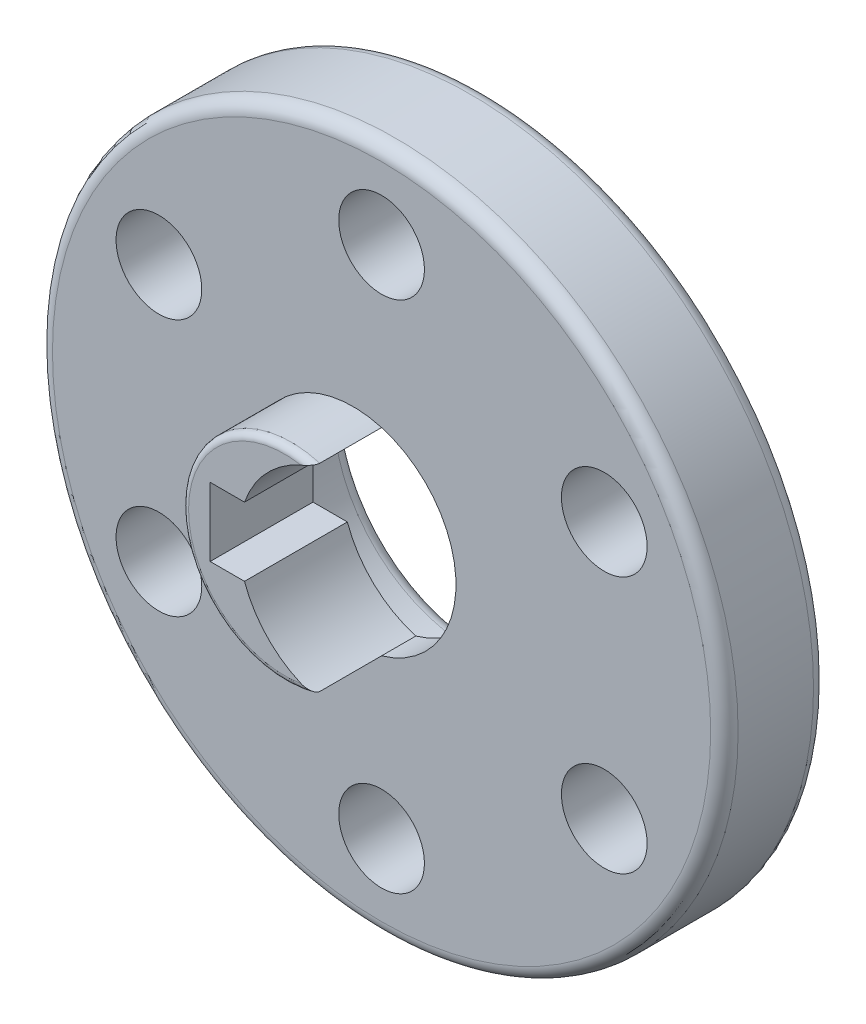
ISO-10303-21;
HEADER;
FILE_DESCRIPTION(('STEP AP214'),'2;1');
FILE_NAME('part.step','',(''),(''),'','','');
FILE_SCHEMA(('AUTOMOTIVE_DESIGN { 1 0 10303 214 1 1 1 1 }'));
ENDSEC;
DATA;
#1=APPLICATION_CONTEXT('core data for automotive mechanical design processes');
#2=APPLICATION_PROTOCOL_DEFINITION('international standard','automotive_design',2000,#1);
#3=PRODUCT_CONTEXT('',#1,'mechanical');
#4=PRODUCT('Part','Part','',(#3));
#5=PRODUCT_RELATED_PRODUCT_CATEGORY('part','',(#4));
#6=PRODUCT_DEFINITION_FORMATION('','',#4);
#7=PRODUCT_DEFINITION_CONTEXT('part definition',#1,'design');
#8=PRODUCT_DEFINITION('design','',#6,#7);
#9=PRODUCT_DEFINITION_SHAPE('','',#8);
#10=(LENGTH_UNIT() NAMED_UNIT(*) SI_UNIT(.MILLI.,.METRE.));
#11=(NAMED_UNIT(*) PLANE_ANGLE_UNIT() SI_UNIT($,.RADIAN.));
#12=(NAMED_UNIT(*) SI_UNIT($,.STERADIAN.) SOLID_ANGLE_UNIT());
#13=UNCERTAINTY_MEASURE_WITH_UNIT(LENGTH_MEASURE(1.E-05),#10,'distance_accuracy_value','');
#14=(GEOMETRIC_REPRESENTATION_CONTEXT(3) GLOBAL_UNCERTAINTY_ASSIGNED_CONTEXT((#13)) GLOBAL_UNIT_ASSIGNED_CONTEXT((#10,
#11,#12)) REPRESENTATION_CONTEXT('',''));
#15=CARTESIAN_POINT('',(0.,0.,0.));
#16=DIRECTION('',(0.,0.,1.));
#17=DIRECTION('',(1.,0.,0.));
#18=AXIS2_PLACEMENT_3D('',#15,#16,#17);
#19=CARTESIAN_POINT('',(12.9903810567666,-7.5,58.));
#20=DIRECTION('',(0.,0.,1.));
#21=DIRECTION('',(-1.,0.,0.));
#22=AXIS2_PLACEMENT_3D('',#19,#20,#21);
#23=CYLINDRICAL_SURFACE('',#22,2.5);
#24=CARTESIAN_POINT('',(12.9903810567666,-7.5,64.));
#25=DIRECTION('',(0.,0.,-1.));
#26=DIRECTION('',(-1.,0.,0.));
#27=AXIS2_PLACEMENT_3D('',#24,#25,#26);
#28=CIRCLE('',#27,2.5);
#29=CARTESIAN_POINT('',(15.4903810567666,-7.5,64.));
#30=VERTEX_POINT('',#29);
#31=EDGE_CURVE('E298',#30,#30,#28,.T.);
#32=ORIENTED_EDGE('',*,*,#31,.F.);
#33=DIRECTION('',(0.,0.,-1.));
#34=VECTOR('',#33,1.);
#35=CARTESIAN_POINT('',(15.4903810567666,-7.5,58.));
#36=LINE('',#35,#34);
#37=CARTESIAN_POINT('',(15.4903810567666,-7.5,58.));
#38=VERTEX_POINT('',#37);
#39=EDGE_CURVE('E11',#30,#38,#36,.T.);
#40=ORIENTED_EDGE('',*,*,#39,.T.);
#41=CARTESIAN_POINT('',(12.9903810567666,-7.5,58.));
#42=DIRECTION('',(0.,0.,-1.));
#43=DIRECTION('',(-1.,0.,0.));
#44=AXIS2_PLACEMENT_3D('',#41,#42,#43);
#45=CIRCLE('',#44,2.5);
#46=EDGE_CURVE('E251',#38,#38,#45,.T.);
#47=ORIENTED_EDGE('',*,*,#46,.T.);
#48=ORIENTED_EDGE('',*,*,#39,.F.);
#49=EDGE_LOOP('',(#32,#40,#47,#48));
#50=FACE_BOUND('',#49,.T.);
#51=ADVANCED_FACE('F17',(#50),#23,.F.);
#52=CARTESIAN_POINT('',(0.,15.,58.));
#53=DIRECTION('',(0.,0.,1.));
#54=DIRECTION('',(-1.,0.,0.));
#55=AXIS2_PLACEMENT_3D('',#52,#53,#54);
#56=CYLINDRICAL_SURFACE('',#55,2.5);
#57=CARTESIAN_POINT('',(0.,15.,64.));
#58=DIRECTION('',(0.,0.,-1.));
#59=DIRECTION('',(-1.,0.,0.));
#60=AXIS2_PLACEMENT_3D('',#57,#58,#59);
#61=CIRCLE('',#60,2.5);
#62=CARTESIAN_POINT('',(2.5,15.,64.));
#63=VERTEX_POINT('',#62);
#64=EDGE_CURVE('E302',#63,#63,#61,.T.);
#65=ORIENTED_EDGE('',*,*,#64,.F.);
#66=DIRECTION('',(0.,0.,-1.));
#67=VECTOR('',#66,1.);
#68=CARTESIAN_POINT('',(2.5,15.,58.));
#69=LINE('',#68,#67);
#70=CARTESIAN_POINT('',(2.5,15.,58.));
#71=VERTEX_POINT('',#70);
#72=EDGE_CURVE('E26',#63,#71,#69,.T.);
#73=ORIENTED_EDGE('',*,*,#72,.T.);
#74=CARTESIAN_POINT('',(0.,15.,58.));
#75=DIRECTION('',(0.,0.,-1.));
#76=DIRECTION('',(-1.,0.,0.));
#77=AXIS2_PLACEMENT_3D('',#74,#75,#76);
#78=CIRCLE('',#77,2.5);
#79=EDGE_CURVE('E257',#71,#71,#78,.T.);
#80=ORIENTED_EDGE('',*,*,#79,.T.);
#81=ORIENTED_EDGE('',*,*,#72,.F.);
#82=EDGE_LOOP('',(#65,#73,#80,#81));
#83=FACE_BOUND('',#82,.T.);
#84=ADVANCED_FACE('F452',(#83),#56,.F.);
#85=CARTESIAN_POINT('',(-12.9903810567666,-7.5,58.));
#86=DIRECTION('',(0.,0.,1.));
#87=DIRECTION('',(-1.,0.,0.));
#88=AXIS2_PLACEMENT_3D('',#85,#86,#87);
#89=CYLINDRICAL_SURFACE('',#88,2.5);
#90=CARTESIAN_POINT('',(-12.9903810567666,-7.5,64.));
#91=DIRECTION('',(0.,0.,-1.));
#92=DIRECTION('',(-1.,0.,0.));
#93=AXIS2_PLACEMENT_3D('',#90,#91,#92);
#94=CIRCLE('',#93,2.5);
#95=CARTESIAN_POINT('',(-10.4903810567666,-7.5,64.));
#96=VERTEX_POINT('',#95);
#97=EDGE_CURVE('E328',#96,#96,#94,.T.);
#98=ORIENTED_EDGE('',*,*,#97,.F.);
#99=DIRECTION('',(0.,0.,-1.));
#100=VECTOR('',#99,1.);
#101=CARTESIAN_POINT('',(-10.4903810567666,-7.5,58.));
#102=LINE('',#101,#100);
#103=CARTESIAN_POINT('',(-10.4903810567666,-7.5,58.));
#104=VERTEX_POINT('',#103);
#105=EDGE_CURVE('E363',#96,#104,#102,.T.);
#106=ORIENTED_EDGE('',*,*,#105,.T.);
#107=CARTESIAN_POINT('',(-12.9903810567666,-7.5,58.));
#108=DIRECTION('',(0.,0.,-1.));
#109=DIRECTION('',(-1.,0.,0.));
#110=AXIS2_PLACEMENT_3D('',#107,#108,#109);
#111=CIRCLE('',#110,2.5);
#112=EDGE_CURVE('E261',#104,#104,#111,.T.);
#113=ORIENTED_EDGE('',*,*,#112,.T.);
#114=ORIENTED_EDGE('',*,*,#105,.F.);
#115=EDGE_LOOP('',(#98,#106,#113,#114));
#116=FACE_BOUND('',#115,.T.);
#117=ADVANCED_FACE('F449',(#116),#89,.F.);
#118=CARTESIAN_POINT('',(0.,-15.,58.));
#119=DIRECTION('',(0.,0.,1.));
#120=DIRECTION('',(-1.,0.,0.));
#121=AXIS2_PLACEMENT_3D('',#118,#119,#120);
#122=CYLINDRICAL_SURFACE('',#121,2.5);
#123=CARTESIAN_POINT('',(0.,-15.,64.));
#124=DIRECTION('',(0.,0.,-1.));
#125=DIRECTION('',(-1.,0.,0.));
#126=AXIS2_PLACEMENT_3D('',#123,#124,#125);
#127=CIRCLE('',#126,2.5);
#128=CARTESIAN_POINT('',(2.5,-15.,64.));
#129=VERTEX_POINT('',#128);
#130=EDGE_CURVE('E332',#129,#129,#127,.T.);
#131=ORIENTED_EDGE('',*,*,#130,.F.);
#132=DIRECTION('',(0.,0.,-1.));
#133=VECTOR('',#132,1.);
#134=CARTESIAN_POINT('',(2.5,-15.,58.));
#135=LINE('',#134,#133);
#136=CARTESIAN_POINT('',(2.5,-15.,58.));
#137=VERTEX_POINT('',#136);
#138=EDGE_CURVE('E360',#129,#137,#135,.T.);
#139=ORIENTED_EDGE('',*,*,#138,.T.);
#140=CARTESIAN_POINT('',(0.,-15.,58.));
#141=DIRECTION('',(0.,0.,-1.));
#142=DIRECTION('',(-1.,0.,0.));
#143=AXIS2_PLACEMENT_3D('',#140,#141,#142);
#144=CIRCLE('',#143,2.5);
#145=EDGE_CURVE('E265',#137,#137,#144,.T.);
#146=ORIENTED_EDGE('',*,*,#145,.T.);
#147=ORIENTED_EDGE('',*,*,#138,.F.);
#148=EDGE_LOOP('',(#131,#139,#146,#147));
#149=FACE_BOUND('',#148,.T.);
#150=ADVANCED_FACE('F445',(#149),#122,.F.);
#151=CARTESIAN_POINT('',(12.9903810567666,7.5,58.));
#152=DIRECTION('',(0.,0.,1.));
#153=DIRECTION('',(-1.,0.,0.));
#154=AXIS2_PLACEMENT_3D('',#151,#152,#153);
#155=CYLINDRICAL_SURFACE('',#154,2.5);
#156=CARTESIAN_POINT('',(12.9903810567666,7.5,64.));
#157=DIRECTION('',(0.,0.,-1.));
#158=DIRECTION('',(-1.,0.,0.));
#159=AXIS2_PLACEMENT_3D('',#156,#157,#158);
#160=CIRCLE('',#159,2.5);
#161=CARTESIAN_POINT('',(15.4903810567666,7.5,64.));
#162=VERTEX_POINT('',#161);
#163=EDGE_CURVE('E336',#162,#162,#160,.T.);
#164=ORIENTED_EDGE('',*,*,#163,.F.);
#165=DIRECTION('',(0.,0.,-1.));
#166=VECTOR('',#165,1.);
#167=CARTESIAN_POINT('',(15.4903810567666,7.5,58.));
#168=LINE('',#167,#166);
#169=CARTESIAN_POINT('',(15.4903810567666,7.5,58.));
#170=VERTEX_POINT('',#169);
#171=EDGE_CURVE('E342',#162,#170,#168,.T.);
#172=ORIENTED_EDGE('',*,*,#171,.T.);
#173=CARTESIAN_POINT('',(12.9903810567666,7.5,58.));
#174=DIRECTION('',(0.,0.,-1.));
#175=DIRECTION('',(-1.,0.,0.));
#176=AXIS2_PLACEMENT_3D('',#173,#174,#175);
#177=CIRCLE('',#176,2.5);
#178=EDGE_CURVE('E266',#170,#170,#177,.T.);
#179=ORIENTED_EDGE('',*,*,#178,.T.);
#180=ORIENTED_EDGE('',*,*,#171,.F.);
#181=EDGE_LOOP('',(#164,#172,#179,#180));
#182=FACE_BOUND('',#181,.T.);
#183=ADVANCED_FACE('F441',(#182),#155,.F.);
#184=CARTESIAN_POINT('',(-12.9903810567666,7.5,58.));
#185=DIRECTION('',(0.,0.,1.));
#186=DIRECTION('',(-1.,0.,0.));
#187=AXIS2_PLACEMENT_3D('',#184,#185,#186);
#188=CYLINDRICAL_SURFACE('',#187,2.5);
#189=CARTESIAN_POINT('',(-12.9903810567666,7.5,64.));
#190=DIRECTION('',(0.,0.,-1.));
#191=DIRECTION('',(-1.,0.,0.));
#192=AXIS2_PLACEMENT_3D('',#189,#190,#191);
#193=CIRCLE('',#192,2.5);
#194=CARTESIAN_POINT('',(-10.4903810567666,7.5,64.));
#195=VERTEX_POINT('',#194);
#196=EDGE_CURVE('E212',#195,#195,#193,.T.);
#197=ORIENTED_EDGE('',*,*,#196,.F.);
#198=DIRECTION('',(0.,0.,-1.));
#199=VECTOR('',#198,1.);
#200=CARTESIAN_POINT('',(-10.4903810567666,7.5,58.));
#201=LINE('',#200,#199);
#202=CARTESIAN_POINT('',(-10.4903810567666,7.5,58.));
#203=VERTEX_POINT('',#202);
#204=EDGE_CURVE('E316',#195,#203,#201,.T.);
#205=ORIENTED_EDGE('',*,*,#204,.T.);
#206=CARTESIAN_POINT('',(-12.9903810567666,7.5,58.));
#207=DIRECTION('',(0.,0.,-1.));
#208=DIRECTION('',(-1.,0.,0.));
#209=AXIS2_PLACEMENT_3D('',#206,#207,#208);
#210=CIRCLE('',#209,2.5);
#211=EDGE_CURVE('E270',#203,#203,#210,.T.);
#212=ORIENTED_EDGE('',*,*,#211,.T.);
#213=ORIENTED_EDGE('',*,*,#204,.F.);
#214=EDGE_LOOP('',(#197,#205,#212,#213));
#215=FACE_BOUND('',#214,.T.);
#216=ADVANCED_FACE('F438',(#215),#188,.F.);
#217=CARTESIAN_POINT('',(-1.66,0.,68.));
#218=DIRECTION('',(0.,0.,1.));
#219=DIRECTION('',(1.,0.,0.));
#220=AXIS2_PLACEMENT_3D('',#217,#218,#219);
#221=PLANE('',#220);
#222=CARTESIAN_POINT('',(-1.66,0.,68.));
#223=DIRECTION('',(0.,0.,-1.));
#224=DIRECTION('',(-1.,0.,0.));
#225=AXIS2_PLACEMENT_3D('',#222,#223,#224);
#226=CIRCLE('',#225,5.6);
#227=CARTESIAN_POINT('',(-0.698795180722892,-5.5168909084192,68.));
#228=VERTEX_POINT('',#227);
#229=CARTESIAN_POINT('',(-0.698795180722892,5.5168909084192,68.));
#230=VERTEX_POINT('',#229);
#231=EDGE_CURVE('E519',#228,#230,#226,.T.);
#232=ORIENTED_EDGE('',*,*,#231,.F.);
#233=CARTESIAN_POINT('',(1.66,0.,68.));
#234=DIRECTION('',(0.,0.,-1.));
#235=DIRECTION('',(0.,-1.,0.));
#236=AXIS2_PLACEMENT_3D('',#233,#234,#235);
#237=CIRCLE('',#236,6.);
#238=CARTESIAN_POINT('',(-3.99685423895567,-2.00000002980232,68.));
#239=VERTEX_POINT('',#238);
#240=EDGE_CURVE('E350',#228,#239,#237,.T.);
#241=ORIENTED_EDGE('',*,*,#240,.T.);
#242=DIRECTION('',(-1.,0.,0.));
#243=VECTOR('',#242,1.);
#244=CARTESIAN_POINT('',(-3.83000004470348,-2.00000002980232,68.));
#245=LINE('',#244,#243);
#246=CARTESIAN_POINT('',(-6.00000008940697,-2.00000002980232,68.));
#247=VERTEX_POINT('',#246);
#248=EDGE_CURVE('E49',#239,#247,#245,.T.);
#249=ORIENTED_EDGE('',*,*,#248,.T.);
#250=DIRECTION('',(0.,1.,0.));
#251=VECTOR('',#250,1.);
#252=CARTESIAN_POINT('',(-6.00000008940697,1.00000001490116,68.));
#253=LINE('',#252,#251);
#254=CARTESIAN_POINT('',(-6.00000008940697,2.00000002980232,68.));
#255=VERTEX_POINT('',#254);
#256=EDGE_CURVE('E346',#247,#255,#253,.T.);
#257=ORIENTED_EDGE('',*,*,#256,.T.);
#258=DIRECTION('',(1.,0.,0.));
#259=VECTOR('',#258,1.);
#260=CARTESIAN_POINT('',(-2.82842711947783,2.00000002980232,68.));
#261=LINE('',#260,#259);
#262=CARTESIAN_POINT('',(-3.99685423895567,2.00000002980232,68.));
#263=VERTEX_POINT('',#262);
#264=EDGE_CURVE('E39',#255,#263,#261,.T.);
#265=ORIENTED_EDGE('',*,*,#264,.T.);
#266=CARTESIAN_POINT('',(1.66,0.,68.));
#267=DIRECTION('',(0.,0.,-1.));
#268=DIRECTION('',(0.,-1.,0.));
#269=AXIS2_PLACEMENT_3D('',#266,#267,#268);
#270=CIRCLE('',#269,6.);
#271=EDGE_CURVE('E282',#263,#230,#270,.T.);
#272=ORIENTED_EDGE('',*,*,#271,.T.);
#273=EDGE_LOOP('',(#232,#241,#249,#257,#265,#272));
#274=FACE_BOUND('',#273,.T.);
#275=ADVANCED_FACE('F436',(#274),#221,.T.);
#276=CARTESIAN_POINT('',(-6.00000008940697,-2.00000002980232,68.));
#277=DIRECTION('',(0.,1.,0.));
#278=DIRECTION('',(1.,0.,0.));
#279=AXIS2_PLACEMENT_3D('',#276,#277,#278);
#280=PLANE('',#279);
#281=ORIENTED_EDGE('',*,*,#248,.F.);
#282=DIRECTION('',(0.,0.,-1.));
#283=VECTOR('',#282,1.);
#284=CARTESIAN_POINT('',(-3.99685423895567,-2.00000002980232,68.));
#285=LINE('',#284,#283);
#286=CARTESIAN_POINT('',(-3.99685423895567,-2.00000002980232,62.));
#287=VERTEX_POINT('',#286);
#288=EDGE_CURVE('E211',#239,#287,#285,.T.);
#289=ORIENTED_EDGE('',*,*,#288,.T.);
#290=DIRECTION('',(1.,0.,0.));
#291=VECTOR('',#290,1.);
#292=CARTESIAN_POINT('',(-3.00000004470348,-2.00000002980232,62.));
#293=LINE('',#292,#291);
#294=CARTESIAN_POINT('',(-6.00000008940697,-2.00000002980232,62.));
#295=VERTEX_POINT('',#294);
#296=EDGE_CURVE('E229',#295,#287,#293,.T.);
#297=ORIENTED_EDGE('',*,*,#296,.F.);
#298=DIRECTION('',(0.,0.,-1.));
#299=VECTOR('',#298,1.);
#300=CARTESIAN_POINT('',(-6.00000008940697,-2.00000002980232,68.));
#301=LINE('',#300,#299);
#302=EDGE_CURVE('E349',#247,#295,#301,.T.);
#303=ORIENTED_EDGE('',*,*,#302,.F.);
#304=EDGE_LOOP('',(#281,#289,#297,#303));
#305=FACE_BOUND('',#304,.T.);
#306=ADVANCED_FACE('F433',(#305),#280,.T.);
#307=CARTESIAN_POINT('',(-3.99685423895567,2.00000002980232,68.));
#308=DIRECTION('',(0.,-1.,0.));
#309=DIRECTION('',(0.,0.,-1.));
#310=AXIS2_PLACEMENT_3D('',#307,#308,#309);
#311=PLANE('',#310);
#312=ORIENTED_EDGE('',*,*,#264,.F.);
#313=DIRECTION('',(0.,0.,-1.));
#314=VECTOR('',#313,1.);
#315=CARTESIAN_POINT('',(-6.00000008940697,2.00000002980232,68.));
#316=LINE('',#315,#314);
#317=CARTESIAN_POINT('',(-6.00000008940697,2.00000002980232,62.));
#318=VERTEX_POINT('',#317);
#319=EDGE_CURVE('E353',#255,#318,#316,.T.);
#320=ORIENTED_EDGE('',*,*,#319,.T.);
#321=DIRECTION('',(-1.,0.,0.));
#322=VECTOR('',#321,1.);
#323=CARTESIAN_POINT('',(-1.99842711947783,2.00000002980232,62.));
#324=LINE('',#323,#322);
#325=CARTESIAN_POINT('',(-3.99685423895567,2.00000002980232,62.));
#326=VERTEX_POINT('',#325);
#327=EDGE_CURVE('E246',#326,#318,#324,.T.);
#328=ORIENTED_EDGE('',*,*,#327,.F.);
#329=DIRECTION('',(0.,0.,-1.));
#330=VECTOR('',#329,1.);
#331=CARTESIAN_POINT('',(-3.99685423895567,2.00000002980232,68.));
#332=LINE('',#331,#330);
#333=EDGE_CURVE('E280',#263,#326,#332,.T.);
#334=ORIENTED_EDGE('',*,*,#333,.F.);
#335=EDGE_LOOP('',(#312,#320,#328,#334));
#336=FACE_BOUND('',#335,.T.);
#337=ADVANCED_FACE('F431',(#336),#311,.T.);
#338=CARTESIAN_POINT('',(-6.00000008940697,2.00000002980232,68.));
#339=DIRECTION('',(1.,0.,0.));
#340=DIRECTION('',(0.,1.,0.));
#341=AXIS2_PLACEMENT_3D('',#338,#339,#340);
#342=PLANE('',#341);
#343=ORIENTED_EDGE('',*,*,#256,.F.);
#344=ORIENTED_EDGE('',*,*,#302,.T.);
#345=DIRECTION('',(0.,-1.,0.));
#346=VECTOR('',#345,1.);
#347=CARTESIAN_POINT('',(-6.00000008940697,1.00000001490116,62.));
#348=LINE('',#347,#346);
#349=EDGE_CURVE('E236',#318,#295,#348,.T.);
#350=ORIENTED_EDGE('',*,*,#349,.F.);
#351=ORIENTED_EDGE('',*,*,#319,.F.);
#352=EDGE_LOOP('',(#343,#344,#350,#351));
#353=FACE_BOUND('',#352,.T.);
#354=ADVANCED_FACE('F428',(#353),#342,.T.);
#355=CARTESIAN_POINT('',(-1.66,0.,68.));
#356=DIRECTION('',(0.,0.,-1.));
#357=DIRECTION('',(0.,-1.,0.));
#358=AXIS2_PLACEMENT_3D('',#355,#356,#357);
#359=CYLINDRICAL_SURFACE('',#358,6.);
#360=CARTESIAN_POINT('',(-1.66,0.,64.));
#361=DIRECTION('',(0.,0.,-1.));
#362=DIRECTION('',(0.,-1.,0.));
#363=AXIS2_PLACEMENT_3D('',#360,#361,#362);
#364=CIRCLE('',#363,6.);
#365=CARTESIAN_POINT('',(0.,5.7657956953052,64.));
#366=VERTEX_POINT('',#365);
#367=CARTESIAN_POINT('',(0.,-5.7657956953052,64.));
#368=VERTEX_POINT('',#367);
#369=EDGE_CURVE('E303',#366,#368,#364,.T.);
#370=ORIENTED_EDGE('',*,*,#369,.F.);
#371=DIRECTION('',(0.,0.,1.));
#372=VECTOR('',#371,1.);
#373=CARTESIAN_POINT('',(0.,5.7657956953052,68.));
#374=LINE('',#373,#372);
#375=CARTESIAN_POINT('',(0.,5.7657956953052,62.));
#376=VERTEX_POINT('',#375);
#377=EDGE_CURVE('E218',#376,#366,#374,.T.);
#378=ORIENTED_EDGE('',*,*,#377,.F.);
#379=CARTESIAN_POINT('',(-1.66,0.,62.));
#380=DIRECTION('',(0.,0.,1.));
#381=DIRECTION('',(0.,-1.,0.));
#382=AXIS2_PLACEMENT_3D('',#379,#380,#381);
#383=CIRCLE('',#382,6.);
#384=CARTESIAN_POINT('',(0.,-5.7657956953052,62.));
#385=VERTEX_POINT('',#384);
#386=EDGE_CURVE('E215',#385,#376,#383,.T.);
#387=ORIENTED_EDGE('',*,*,#386,.F.);
#388=DIRECTION('',(0.,0.,-1.));
#389=VECTOR('',#388,1.);
#390=CARTESIAN_POINT('',(0.,-5.7657956953052,68.));
#391=LINE('',#390,#389);
#392=EDGE_CURVE('E198',#368,#385,#391,.T.);
#393=ORIENTED_EDGE('',*,*,#392,.F.);
#394=EDGE_LOOP('',(#370,#378,#387,#393));
#395=FACE_BOUND('',#394,.T.);
#396=ADVANCED_FACE('F216',(#395),#359,.F.);
#397=CARTESIAN_POINT('',(1.66,0.,68.));
#398=DIRECTION('',(0.,0.,1.));
#399=DIRECTION('',(0.,-1.,0.));
#400=AXIS2_PLACEMENT_3D('',#397,#398,#399);
#401=CYLINDRICAL_SURFACE('',#400,6.);
#402=CARTESIAN_POINT('',(0.,-5.7657956953052,67.6));
#403=CARTESIAN_POINT('',(2.99132508018283E-07,-5.76579578354615,67.6038054220453));
#404=CARTESIAN_POINT('',(-9.96529516299782E-05,-5.7657678825914,67.6076106965342));
#405=CARTESIAN_POINT('',(-0.00049761238309578,-5.76565617932427,67.6152265545944));
#406=CARTESIAN_POINT('',(-0.000796472790109124,-5.76557213622888,67.6190370901795));
#407=CARTESIAN_POINT('',(-0.00159228289236606,-5.76534751469724,67.6266602906745));
#408=CARTESIAN_POINT('',(-0.00209048502516007,-5.7652065787601,67.630472813874));
#409=CARTESIAN_POINT('',(-0.00328452277740689,-5.76486769107491,67.6380969384565));
#410=CARTESIAN_POINT('',(-0.00398197855112067,-5.76466927172844,67.6419082647347));
#411=CARTESIAN_POINT('',(-0.00557415150221619,-5.7642149222048,67.6495269176029));
#412=CARTESIAN_POINT('',(-0.00647082015965356,-5.76395842256223,67.6533338014986));
#413=CARTESIAN_POINT('',(-0.00846098454605882,-5.76338744720585,67.6609405018782));
#414=CARTESIAN_POINT('',(-0.00955671973494868,-5.76307231074782,67.6647396816188));
#415=CARTESIAN_POINT('',(-0.0119445662142221,-5.76238361401434,67.6723278998873));
#416=CARTESIAN_POINT('',(-0.0132391584730796,-5.76200931359561,67.6761160889686));
#417=CARTESIAN_POINT('',(-0.0160242424679784,-5.76120186251344,67.6836792437355));
#418=CARTESIAN_POINT('',(-0.017517408739065,-5.76076790502808,67.6874531365076));
#419=CARTESIAN_POINT('',(-0.0206991416848057,-5.7598407349358,67.6949846022297));
#420=CARTESIAN_POINT('',(-0.0223905291625448,-5.75934666177692,67.6987408753625));
#421=CARTESIAN_POINT('',(-0.0259681805804196,-5.75829887890087,67.7062339870996));
#422=CARTESIAN_POINT('',(-0.0278573664881923,-5.757744267609,67.7099693020302));
#423=CARTESIAN_POINT('',(-0.0318300632885595,-5.75657505261038,67.7174173608912));
#424=CARTESIAN_POINT('',(-0.0339165556346515,-5.755959518383,67.7211283657472));
#425=CARTESIAN_POINT('',(-0.0382832822170189,-5.75466812937108,67.7285246447401));
#426=CARTESIAN_POINT('',(-0.0405665199490919,-5.7539913262772,67.7322079771247));
#427=CARTESIAN_POINT('',(-0.0453261187133187,-5.7525771031158,67.7395457251408));
#428=CARTESIAN_POINT('',(-0.0478054725464525,-5.75183872703816,67.7431980121308));
#429=CARTESIAN_POINT('',(-0.0529566427362297,-5.75030109095984,67.7504704659432));
#430=CARTESIAN_POINT('',(-0.0556314132641666,-5.74950087604065,67.7540883352508));
#431=CARTESIAN_POINT('',(-0.0611727172552679,-5.7478393472473,67.7612887013855));
#432=CARTESIAN_POINT('',(-0.0640421432469939,-5.74697708754432,67.7648687502579));
#433=CARTESIAN_POINT('',(-0.0699719850441191,-5.74519123348772,67.7719903037545));
#434=CARTESIAN_POINT('',(-0.0730352125421153,-5.7442667075684,67.775529231537));
#435=CARTESIAN_POINT('',(-0.0786130669992424,-5.74257980930535,67.7817420045996));
#436=CARTESIAN_POINT('',(-0.0811046102094946,-5.74182513715866,67.7844387377499));
#437=CARTESIAN_POINT('',(-0.0862108566076663,-5.74027558505848,67.789817073972));
#438=CARTESIAN_POINT('',(-0.0888270559963717,-5.73948018949543,67.7924971053693));
#439=CARTESIAN_POINT('',(-0.0969458403100019,-5.73700623544534,67.8005973887025));
#440=CARTESIAN_POINT('',(-0.102556627114539,-5.73528879495159,67.8058979408594));
#441=CARTESIAN_POINT('',(-0.114261638807368,-5.73168566385685,67.8164207070436));
#442=CARTESIAN_POINT('',(-0.120366276645932,-5.7297959190847,67.8216298798344));
#443=CARTESIAN_POINT('',(-0.133057101479654,-5.72584233447163,67.8319536513541));
#444=CARTESIAN_POINT('',(-0.139652744213313,-5.72377451578418,67.8370550763582));
#445=CARTESIAN_POINT('',(-0.1533225144171,-5.71945967473087,67.8471459998547));
#446=CARTESIAN_POINT('',(-0.160405163867207,-5.71720877974199,67.8521222615238));
#447=CARTESIAN_POINT('',(-0.175045369219113,-5.71252320173427,67.8619451765522));
#448=CARTESIAN_POINT('',(-0.182610575883047,-5.71008476814087,67.8667786080071));
#449=CARTESIAN_POINT('',(-0.198211741908994,-5.70502047248712,67.8762975257471));
#450=CARTESIAN_POINT('',(-0.206254544388413,-5.70239100981025,67.8809698486539));
#451=CARTESIAN_POINT('',(-0.222805624657741,-5.69694087185607,67.8901485219546));
#452=CARTESIAN_POINT('',(-0.231319980470926,-5.69411672722249,67.8946418320442));
#453=CARTESIAN_POINT('',(-0.247344220327163,-5.68876725946606,67.9027039795353));
#454=CARTESIAN_POINT('',(-0.254835985262655,-5.68625254527051,67.9063160505888));
#455=CARTESIAN_POINT('',(-0.270258795029203,-5.68104436416362,67.9134544022188));
#456=CARTESIAN_POINT('',(-0.278194208022459,-5.6783479928485,67.9169691165044));
#457=CARTESIAN_POINT('',(-0.294500413417837,-5.67276773505114,67.923892532807));
#458=CARTESIAN_POINT('',(-0.302875017120498,-5.66988081475706,67.9272897935834));
#459=CARTESIAN_POINT('',(-0.320055653137579,-5.66391245153418,67.9339566627574));
#460=CARTESIAN_POINT('',(-0.328865022183688,-5.6608279330306,67.9372149011061));
#461=CARTESIAN_POINT('',(-0.346910335624224,-5.65445782850699,67.9435815493562));
#462=CARTESIAN_POINT('',(-0.356149176784656,-5.65116914682667,67.9466786484162));
#463=CARTESIAN_POINT('',(-0.375047974827085,-5.64438684848527,67.9526994452198));
#464=CARTESIAN_POINT('',(-0.384710429057125,-5.64089022003481,67.9556118461188));
#465=CARTESIAN_POINT('',(-0.414853572534665,-5.62988581094507,67.9642082445295));
#466=CARTESIAN_POINT('',(-0.435431521923941,-5.62223591869659,67.9693783055996));
#467=CARTESIAN_POINT('',(-0.471948420374829,-5.60848748269953,67.9773962857684));
#468=CARTESIAN_POINT('',(-0.487851811257341,-5.60244249052696,67.9805045989131));
#469=CARTESIAN_POINT('',(-0.522593339699834,-5.58906114339681,67.9865193151226));
#470=CARTESIAN_POINT('',(-0.541441843307514,-5.58168903205711,67.9892874293857));
#471=CARTESIAN_POINT('',(-0.582000392437134,-5.56554330829036,67.9942256024856));
#472=CARTESIAN_POINT('',(-0.603711897315566,-5.55672641404013,67.9962417997141));
#473=CARTESIAN_POINT('',(-0.649904549128925,-5.53764299074259,67.9992137299338));
#474=CARTESIAN_POINT('',(-0.674380372925163,-5.52733656173716,67.9999983847929));
#475=CARTESIAN_POINT('',(-0.698795180722888,-5.5168909084192,68.));
#476=B_SPLINE_CURVE_WITH_KNOTS('',3,(#402,#403,#404,#405,#406,#407,#408,#409,#410,#411,#412,
#413,#414,#415,#416,#417,#418,#419,#420,#421,#422,#423,#424,#425,#426,#427,#428,#429,#430,#431,
#432,#433,#434,#435,#436,#437,#438,#439,#440,#441,#442,#443,#444,#445,#446,#447,#448,#449,#450,
#451,#452,#453,#454,#455,#456,#457,#458,#459,#460,#461,#462,#463,#464,#465,#466,#467,#468,#469,
#470,#471,#472,#473,#474,#475),.UNSPECIFIED.,.F.,.F.,(4,2,2,2,2,2,2,2,2,2,2,2,2,2,2,2,2,2,2,2,2,
2,2,2,2,2,2,2,2,2,2,2,2,2,2,2,4),(0.,0.0114146263994269,0.0228785249868784,0.0344156100309201,
0.0460493131655042,0.0578024415293923,0.0696970537157143,0.0817543557409704,0.0939946180852143,
0.106437113783786,0.119100076645512,0.132000677977724,0.14515501972843,0.158578141698435,
0.172284040400327,0.186285697208399,0.200595113612507,0.2118385523046,0.223323708874162,
0.247033883102563,0.271757898820535,0.297520910021121,0.324343714917132,0.352243267123748,
0.381233125357591,0.411323847763741,0.437386314148154,0.464646206288442,0.493103708836468,
0.522757520351319,0.553605019843277,0.585642410047132,0.653258984508026,0.705130615020345,
0.766387556107475,0.836913056751069,0.916568752382658),.UNSPECIFIED.);
#477=CARTESIAN_POINT('',(0.,-5.7657956953052,67.6));
#478=VERTEX_POINT('',#477);
#479=EDGE_CURVE('E274',#478,#228,#476,.T.);
#480=ORIENTED_EDGE('',*,*,#479,.F.);
#481=DIRECTION('',(0.,0.,1.));
#482=VECTOR('',#481,1.);
#483=CARTESIAN_POINT('',(0.,-5.7657956953052,68.));
#484=LINE('',#483,#482);
#485=EDGE_CURVE('E206',#368,#478,#484,.T.);
#486=ORIENTED_EDGE('',*,*,#485,.F.);
#487=ORIENTED_EDGE('',*,*,#392,.T.);
#488=CARTESIAN_POINT('',(1.66,0.,62.));
#489=DIRECTION('',(0.,0.,1.));
#490=DIRECTION('',(0.,-1.,0.));
#491=AXIS2_PLACEMENT_3D('',#488,#489,#490);
#492=CIRCLE('',#491,6.);
#493=EDGE_CURVE('E204',#287,#385,#492,.T.);
#494=ORIENTED_EDGE('',*,*,#493,.F.);
#495=ORIENTED_EDGE('',*,*,#288,.F.);
#496=ORIENTED_EDGE('',*,*,#240,.F.);
#497=EDGE_LOOP('',(#480,#486,#487,#494,#495,#496));
#498=FACE_BOUND('',#497,.T.);
#499=ADVANCED_FACE('F201',(#498),#401,.F.);
#500=CARTESIAN_POINT('',(0.,0.,64.));
#501=DIRECTION('',(0.,0.,1.));
#502=DIRECTION('',(1.,0.,0.));
#503=AXIS2_PLACEMENT_3D('',#500,#501,#502);
#504=PLANE('',#503);
#505=ORIENTED_EDGE('',*,*,#196,.T.);
#506=EDGE_LOOP('',(#505));
#507=FACE_BOUND('',#506,.T.);
#508=ORIENTED_EDGE('',*,*,#163,.T.);
#509=EDGE_LOOP('',(#508));
#510=FACE_BOUND('',#509,.T.);
#511=ORIENTED_EDGE('',*,*,#130,.T.);
#512=EDGE_LOOP('',(#511));
#513=FACE_BOUND('',#512,.T.);
#514=ORIENTED_EDGE('',*,*,#97,.T.);
#515=EDGE_LOOP('',(#514));
#516=FACE_BOUND('',#515,.T.);
#517=ORIENTED_EDGE('',*,*,#64,.T.);
#518=EDGE_LOOP('',(#517));
#519=FACE_BOUND('',#518,.T.);
#520=ORIENTED_EDGE('',*,*,#31,.T.);
#521=EDGE_LOOP('',(#520));
#522=FACE_BOUND('',#521,.T.);
#523=CARTESIAN_POINT('',(-1.66,0.,64.));
#524=DIRECTION('',(0.,0.,-1.));
#525=DIRECTION('',(0.,-1.,0.));
#526=AXIS2_PLACEMENT_3D('',#523,#524,#525);
#527=CIRCLE('',#526,6.);
#528=EDGE_CURVE('E275',#368,#366,#527,.T.);
#529=ORIENTED_EDGE('',*,*,#528,.T.);
#530=ORIENTED_EDGE('',*,*,#369,.T.);
#531=EDGE_LOOP('',(#529,#530));
#532=FACE_BOUND('',#531,.T.);
#533=CARTESIAN_POINT('',(0.,0.,64.));
#534=DIRECTION('',(0.,0.,-1.));
#535=DIRECTION('',(-1.,0.,0.));
#536=AXIS2_PLACEMENT_3D('',#533,#534,#535);
#537=CIRCLE('',#536,19.2);
#538=CARTESIAN_POINT('',(-19.2,0.,64.));
#539=VERTEX_POINT('',#538);
#540=EDGE_CURVE('E313',#539,#539,#537,.T.);
#541=ORIENTED_EDGE('',*,*,#540,.F.);
#542=EDGE_LOOP('',(#541));
#543=FACE_BOUND('',#542,.T.);
#544=ADVANCED_FACE('F424',(#507,#510,#513,#516,#519,#522,#532,#543),#504,.T.);
#545=CARTESIAN_POINT('',(0.,0.,63.2));
#546=DIRECTION('',(0.,0.,1.));
#547=DIRECTION('',(1.,0.,0.));
#548=AXIS2_PLACEMENT_3D('',#545,#546,#547);
#549=TOROIDAL_SURFACE('',#548,19.2,0.8);
#550=ORIENTED_EDGE('',*,*,#540,.T.);
#551=CARTESIAN_POINT('',(-19.2,0.,63.2));
#552=DIRECTION('',(0.,-1.,0.));
#553=DIRECTION('',(-1.,0.,0.));
#554=AXIS2_PLACEMENT_3D('',#551,#552,#553);
#555=CIRCLE('',#554,0.8);
#556=CARTESIAN_POINT('',(-20.,0.,63.2));
#557=VERTEX_POINT('',#556);
#558=EDGE_CURVE('E317',#539,#557,#555,.T.);
#559=ORIENTED_EDGE('',*,*,#558,.T.);
#560=CARTESIAN_POINT('',(0.,0.,63.2));
#561=DIRECTION('',(0.,0.,1.));
#562=DIRECTION('',(-1.,0.,0.));
#563=AXIS2_PLACEMENT_3D('',#560,#561,#562);
#564=CIRCLE('',#563,20.);
#565=CARTESIAN_POINT('',(20.,0.,63.2));
#566=VERTEX_POINT('',#565);
#567=EDGE_CURVE('E310',#557,#566,#564,.T.);
#568=ORIENTED_EDGE('',*,*,#567,.T.);
#569=CARTESIAN_POINT('',(0.,0.,63.2));
#570=DIRECTION('',(0.,0.,1.));
#571=DIRECTION('',(-1.,0.,0.));
#572=AXIS2_PLACEMENT_3D('',#569,#570,#571);
#573=CIRCLE('',#572,20.);
#574=EDGE_CURVE('E297',#566,#557,#573,.T.);
#575=ORIENTED_EDGE('',*,*,#574,.T.);
#576=ORIENTED_EDGE('',*,*,#558,.F.);
#577=EDGE_LOOP('',(#550,#559,#568,#575,#576));
#578=FACE_BOUND('',#577,.T.);
#579=ADVANCED_FACE('F466',(#578),#549,.T.);
#580=CARTESIAN_POINT('',(0.,0.,58.));
#581=DIRECTION('',(0.,0.,1.));
#582=DIRECTION('',(-1.,0.,0.));
#583=AXIS2_PLACEMENT_3D('',#580,#581,#582);
#584=CYLINDRICAL_SURFACE('',#583,20.);
#585=ORIENTED_EDGE('',*,*,#574,.F.);
#586=DIRECTION('',(0.,0.,-1.));
#587=VECTOR('',#586,1.);
#588=CARTESIAN_POINT('',(20.,0.,58.));
#589=LINE('',#588,#587);
#590=CARTESIAN_POINT('',(20.,0.,58.8));
#591=VERTEX_POINT('',#590);
#592=EDGE_CURVE('E307',#566,#591,#589,.T.);
#593=ORIENTED_EDGE('',*,*,#592,.T.);
#594=CARTESIAN_POINT('',(0.,0.,58.8));
#595=DIRECTION('',(0.,0.,-1.));
#596=DIRECTION('',(-1.,0.,0.));
#597=AXIS2_PLACEMENT_3D('',#594,#595,#596);
#598=CIRCLE('',#597,20.);
#599=CARTESIAN_POINT('',(-20.,0.,58.8));
#600=VERTEX_POINT('',#599);
#601=EDGE_CURVE('E293',#600,#591,#598,.T.);
#602=ORIENTED_EDGE('',*,*,#601,.F.);
#603=CARTESIAN_POINT('',(0.,0.,58.8));
#604=DIRECTION('',(0.,0.,-1.));
#605=DIRECTION('',(-1.,0.,0.));
#606=AXIS2_PLACEMENT_3D('',#603,#604,#605);
#607=CIRCLE('',#606,20.);
#608=EDGE_CURVE('E286',#591,#600,#607,.T.);
#609=ORIENTED_EDGE('',*,*,#608,.F.);
#610=ORIENTED_EDGE('',*,*,#592,.F.);
#611=ORIENTED_EDGE('',*,*,#567,.F.);
#612=EDGE_LOOP('',(#585,#593,#602,#609,#610,#611));
#613=FACE_BOUND('',#612,.T.);
#614=ADVANCED_FACE('F478',(#613),#584,.T.);
#615=CARTESIAN_POINT('',(0.,0.,58.8));
#616=DIRECTION('',(0.,0.,1.));
#617=DIRECTION('',(1.,0.,0.));
#618=AXIS2_PLACEMENT_3D('',#615,#616,#617);
#619=TOROIDAL_SURFACE('',#618,19.2,0.8);
#620=ORIENTED_EDGE('',*,*,#608,.T.);
#621=CARTESIAN_POINT('',(-19.2,0.,58.8));
#622=DIRECTION('',(0.,-1.,0.));
#623=DIRECTION('',(-1.,0.,0.));
#624=AXIS2_PLACEMENT_3D('',#621,#622,#623);
#625=CIRCLE('',#624,0.8);
#626=CARTESIAN_POINT('',(-19.2,0.,58.));
#627=VERTEX_POINT('',#626);
#628=EDGE_CURVE('E290',#600,#627,#625,.T.);
#629=ORIENTED_EDGE('',*,*,#628,.T.);
#630=CARTESIAN_POINT('',(0.,0.,58.));
#631=DIRECTION('',(0.,0.,1.));
#632=DIRECTION('',(-1.,0.,0.));
#633=AXIS2_PLACEMENT_3D('',#630,#631,#632);
#634=CIRCLE('',#633,19.2);
#635=EDGE_CURVE('E247',#627,#627,#634,.T.);
#636=ORIENTED_EDGE('',*,*,#635,.T.);
#637=ORIENTED_EDGE('',*,*,#628,.F.);
#638=ORIENTED_EDGE('',*,*,#601,.T.);
#639=EDGE_LOOP('',(#620,#629,#636,#637,#638));
#640=FACE_BOUND('',#639,.T.);
#641=ADVANCED_FACE('F482',(#640),#619,.T.);
#642=CARTESIAN_POINT('',(1.66,0.,68.));
#643=DIRECTION('',(0.,0.,1.));
#644=DIRECTION('',(0.,-1.,0.));
#645=AXIS2_PLACEMENT_3D('',#642,#643,#644);
#646=CYLINDRICAL_SURFACE('',#645,6.);
#647=CARTESIAN_POINT('',(-0.698795180722912,5.5168909084192,68.));
#648=CARTESIAN_POINT('',(-0.673452531852936,5.52773452493897,67.999998072163));
#649=CARTESIAN_POINT('',(-0.648044051587188,5.53842952076361,67.9991527019785));
#650=CARTESIAN_POINT('',(-0.60008270721649,5.55822199036644,67.9959482832518));
#651=CARTESIAN_POINT('',(-0.577535104654343,5.56736241954198,67.9937731244874));
#652=CARTESIAN_POINT('',(-0.535410620567648,5.58408772509026,67.9884419014058));
#653=CARTESIAN_POINT('',(-0.515831388151422,5.59171955593257,67.9854515971442));
#654=CARTESIAN_POINT('',(-0.479738074943559,5.60555856450121,67.9789495119827));
#655=CARTESIAN_POINT('',(-0.463212363117296,5.61180536952648,67.9755870287373));
#656=CARTESIAN_POINT('',(-0.435772377771316,5.62208291434433,67.9693040795183));
#657=CARTESIAN_POINT('',(-0.4248228990479,5.62615858325159,67.9666095787019));
#658=CARTESIAN_POINT('',(-0.403371033735972,5.63407168576502,67.9609533852452));
#659=CARTESIAN_POINT('',(-0.392866512307127,5.63791244989878,67.9580044869436));
#660=CARTESIAN_POINT('',(-0.372315290547189,5.64536199772477,67.9518652587243));
#661=CARTESIAN_POINT('',(-0.362265960355563,5.64897411821559,67.9486877958213));
#662=CARTESIAN_POINT('',(-0.342632516808734,5.65596907558104,67.9421180404383));
#663=CARTESIAN_POINT('',(-0.333045334070286,5.65935539431923,67.9387386476849));
#664=CARTESIAN_POINT('',(-0.314343487071489,5.66590441044189,67.9317904661174));
#665=CARTESIAN_POINT('',(-0.30522524947105,5.66907063650937,67.9282346412725));
#666=CARTESIAN_POINT('',(-0.287467756690862,5.67518631727939,67.9209581779137));
#667=CARTESIAN_POINT('',(-0.278824379651911,5.67813930628468,67.9172505889161));
#668=CARTESIAN_POINT('',(-0.262022177487984,5.68383649215458,67.909694346858));
#669=CARTESIAN_POINT('',(-0.253858632203063,5.68658418324866,67.9058588499609));
#670=CARTESIAN_POINT('',(-0.238021732175607,5.69188075773422,67.8980688775697));
#671=CARTESIAN_POINT('',(-0.230342956766758,5.69443300202689,67.8941277234316));
#672=CARTESIAN_POINT('',(-0.214262161010036,5.69974841567461,67.8854970629341));
#673=CARTESIAN_POINT('',(-0.205875698602646,5.70250310686161,67.8807732113453));
#674=CARTESIAN_POINT('',(-0.189602290051484,5.70781034795339,67.871132333461));
#675=CARTESIAN_POINT('',(-0.181708387131684,5.71036660495436,67.8662291157861));
#676=CARTESIAN_POINT('',(-0.16642715385232,5.71528046654153,67.8562476956725));
#677=CARTESIAN_POINT('',(-0.159032003663387,5.71764192983562,67.8511834011469));
#678=CARTESIAN_POINT('',(-0.144754208313937,5.7221694877737,67.8408985313684));
#679=CARTESIAN_POINT('',(-0.137862838188303,5.72433961238343,67.8356918770235));
#680=CARTESIAN_POINT('',(-0.124598069011333,5.72848877252196,67.8251404374936));
#681=CARTESIAN_POINT('',(-0.118214977944454,5.73047197974559,67.8198095187182));
#682=CARTESIAN_POINT('',(-0.105971826048968,5.73425212966898,67.8090276034872));
#683=CARTESIAN_POINT('',(-0.100101051522413,5.73605336744422,67.803590308613));
#684=CARTESIAN_POINT('',(-0.0888863588624293,5.73947521070636,67.7926126300336));
#685=CARTESIAN_POINT('',(-0.0835307027615025,5.74110019835227,67.7870856822354));
#686=CARTESIAN_POINT('',(-0.0758163429924207,5.74343056133135,67.7786444204623));
#687=CARTESIAN_POINT('',(-0.0733360534131088,5.74417813337109,67.7758521847255));
#688=CARTESIAN_POINT('',(-0.0685070854312359,5.74563097819294,67.7702500713179));
#689=CARTESIAN_POINT('',(-0.0661567406003086,5.74633680815448,67.7674417780613));
#690=CARTESIAN_POINT('',(-0.0612245602237913,5.74781587246824,67.761361844411));
#691=CARTESIAN_POINT('',(-0.0586549473673951,5.74858514747351,67.7580793033765));
#692=CARTESIAN_POINT('',(-0.0536810193594722,5.750071588796,67.7514808869582));
#693=CARTESIAN_POINT('',(-0.0512744833293597,5.75078947012661,67.7481668483979));
#694=CARTESIAN_POINT('',(-0.0466273530049109,5.75217326326393,67.7415080650402));
#695=CARTESIAN_POINT('',(-0.0443844993516829,5.7528398951338,67.7381650488418));
#696=CARTESIAN_POINT('',(-0.0400652913971466,5.75412133189261,67.7314510010115));
#697=CARTESIAN_POINT('',(-0.0379866553540723,5.75473685739125,67.7280815767126));
#698=CARTESIAN_POINT('',(-0.0339963801645383,5.75591626652721,67.721317400327));
#699=CARTESIAN_POINT('',(-0.0320824552500752,5.75648086536195,67.7179241232177));
#700=CARTESIAN_POINT('',(-0.0284220290869748,5.75755863841179,67.711114939323));
#701=CARTESIAN_POINT('',(-0.0266732593684029,5.75807251592989,67.7077003650616));
#702=CARTESIAN_POINT('',(-0.023343498612734,5.75904909814272,67.7008512877511));
#703=CARTESIAN_POINT('',(-0.0217602804244086,5.75951248706158,67.6974179666156));
#704=CARTESIAN_POINT('',(-0.018761902701957,5.76038837742289,67.6905340963883));
#705=CARTESIAN_POINT('',(-0.0173445838453557,5.76080153627889,67.6870845729046));
#706=CARTESIAN_POINT('',(-0.0146782075156532,5.76157728515049,67.6801709938942));
#707=CARTESIAN_POINT('',(-0.0134270871091396,5.76194049762185,67.6767078050815));
#708=CARTESIAN_POINT('',(-0.0110932311482123,5.76261670505102,67.6697695813694));
#709=CARTESIAN_POINT('',(-0.0100085590462837,5.76293027914463,67.6662952553856));
#710=CARTESIAN_POINT('',(-0.00800764344789755,5.76350759285377,67.6593374274658));
#711=CARTESIAN_POINT('',(-0.00708962040083353,5.76377185995755,67.6558544819226));
#712=CARTESIAN_POINT('',(-0.00542196465180776,5.76425097398566,67.6488820635969));
#713=CARTESIAN_POINT('',(-0.00467073966492988,5.76446628873912,67.6453930044748));
#714=CARTESIAN_POINT('',(-0.0033365688062388,5.76484793986744,67.6384109779358));
#715=CARTESIAN_POINT('',(-0.00275224661854005,5.76501467706596,67.6349182959132));
#716=CARTESIAN_POINT('',(-0.00175166983871115,5.76529964937826,67.6279316134688));
#717=CARTESIAN_POINT('',(-0.00133428114900879,5.76541821186797,67.6244377891278));
#718=CARTESIAN_POINT('',(-0.000667372209157455,5.76560731133179,67.6174513502665));
#719=CARTESIAN_POINT('',(-0.000416981762397048,5.76567809728402,67.6139588257782));
#720=CARTESIAN_POINT('',(-8.34837300430458E-05,5.76577223710305,67.6069775451951));
#721=CARTESIAN_POINT('',(2.11577399942272E-07,5.76579575761761,67.6034888193599));
#722=CARTESIAN_POINT('',(0.,5.76579569530521,67.6));
#723=B_SPLINE_CURVE_WITH_KNOTS('',3,(#647,#648,#649,#650,#651,#652,#653,#654,#655,#656,#657,
#658,#659,#660,#661,#662,#663,#664,#665,#666,#667,#668,#669,#670,#671,#672,#673,#674,#675,#676,
#677,#678,#679,#680,#681,#682,#683,#684,#685,#686,#687,#688,#689,#690,#691,#692,#693,#694,#695,
#696,#697,#698,#699,#700,#701,#702,#703,#704,#705,#706,#707,#708,#709,#710,#711,#712,#713,#714,
#715,#716,#717,#718,#719,#720,#721,#722),.UNSPECIFIED.,.F.,.F.,(4,2,2,2,2,2,2,2,2,2,2,2,2,2,2,2,
2,2,2,2,2,2,2,2,2,2,2,2,2,2,2,2,2,2,2,2,2,4),(0.,0.082684216758978,0.155925765368073,
0.219575810631461,0.273509050457888,0.309473687149868,0.344168388749441,0.377587171868331,
0.409725230595116,0.440579088656251,0.470146769008069,0.498427987982598,0.525424383063961,
0.555450830335542,0.584355588221068,0.612152584469823,0.638859300294435,0.664497240608075,
0.689092466352156,0.712676192477988,0.724101296595324,0.735287954579883,0.748002380904556,
0.760473750797999,0.772712268691314,0.78472885518378,0.796535163576156,0.808143590670207,
0.819567280566042,0.830820120164269,0.841916725121062,0.852872415127259,0.863703177598099,
0.874425619177659,0.885056904874973,0.895614685145214,0.906117011781003,0.916582244046156),.UNSPECIFIED.);
#724=CARTESIAN_POINT('',(0.,5.7657956953052,67.6));
#725=VERTEX_POINT('',#724);
#726=EDGE_CURVE('E374',#230,#725,#723,.T.);
#727=ORIENTED_EDGE('',*,*,#726,.F.);
#728=ORIENTED_EDGE('',*,*,#271,.F.);
#729=ORIENTED_EDGE('',*,*,#333,.T.);
#730=CARTESIAN_POINT('',(1.66,0.,62.));
#731=DIRECTION('',(0.,0.,1.));
#732=DIRECTION('',(0.,-1.,0.));
#733=AXIS2_PLACEMENT_3D('',#730,#731,#732);
#734=CIRCLE('',#733,6.);
#735=EDGE_CURVE('E223',#376,#326,#734,.T.);
#736=ORIENTED_EDGE('',*,*,#735,.F.);
#737=ORIENTED_EDGE('',*,*,#377,.T.);
#738=DIRECTION('',(0.,0.,-1.));
#739=VECTOR('',#738,1.);
#740=CARTESIAN_POINT('',(0.,5.7657956953052,68.));
#741=LINE('',#740,#739);
#742=EDGE_CURVE('E279',#725,#366,#741,.T.);
#743=ORIENTED_EDGE('',*,*,#742,.F.);
#744=EDGE_LOOP('',(#727,#728,#729,#736,#737,#743));
#745=FACE_BOUND('',#744,.T.);
#746=ADVANCED_FACE('F497',(#745),#646,.F.);
#747=CARTESIAN_POINT('',(-1.66,0.,68.));
#748=DIRECTION('',(0.,0.,-1.));
#749=DIRECTION('',(-1.,0.,0.));
#750=AXIS2_PLACEMENT_3D('',#747,#748,#749);
#751=CYLINDRICAL_SURFACE('',#750,6.);
#752=CARTESIAN_POINT('',(-1.66,0.,67.6));
#753=DIRECTION('',(0.,0.,1.));
#754=DIRECTION('',(-1.,0.,0.));
#755=AXIS2_PLACEMENT_3D('',#752,#753,#754);
#756=CIRCLE('',#755,6.);
#757=EDGE_CURVE('E526',#725,#478,#756,.T.);
#758=ORIENTED_EDGE('',*,*,#757,.F.);
#759=ORIENTED_EDGE('',*,*,#742,.T.);
#760=ORIENTED_EDGE('',*,*,#528,.F.);
#761=ORIENTED_EDGE('',*,*,#485,.T.);
#762=EDGE_LOOP('',(#758,#759,#760,#761));
#763=FACE_BOUND('',#762,.T.);
#764=ADVANCED_FACE('F391',(#763),#751,.T.);
#765=CARTESIAN_POINT('',(-1.66,0.,67.6));
#766=DIRECTION('',(0.,0.,1.));
#767=DIRECTION('',(-1.,0.,0.));
#768=AXIS2_PLACEMENT_3D('',#765,#766,#767);
#769=TOROIDAL_SURFACE('',#768,5.6,0.4);
#770=ORIENTED_EDGE('',*,*,#479,.T.);
#771=ORIENTED_EDGE('',*,*,#231,.T.);
#772=ORIENTED_EDGE('',*,*,#726,.T.);
#773=ORIENTED_EDGE('',*,*,#757,.T.);
#774=EDGE_LOOP('',(#770,#771,#772,#773));
#775=FACE_BOUND('',#774,.T.);
#776=ADVANCED_FACE('F380',(#775),#769,.T.);
#777=CARTESIAN_POINT('',(0.,0.,58.));
#778=DIRECTION('',(0.,0.,1.));
#779=DIRECTION('',(1.,0.,0.));
#780=AXIS2_PLACEMENT_3D('',#777,#778,#779);
#781=PLANE('',#780);
#782=CARTESIAN_POINT('',(0.,0.,58.));
#783=DIRECTION('',(0.,0.,-1.));
#784=DIRECTION('',(-1.,0.,0.));
#785=AXIS2_PLACEMENT_3D('',#782,#783,#784);
#786=CIRCLE('',#785,8.8);
#787=CARTESIAN_POINT('',(8.8,0.,58.));
#788=VERTEX_POINT('',#787);
#789=EDGE_CURVE('E245',#788,#788,#786,.T.);
#790=ORIENTED_EDGE('',*,*,#789,.F.);
#791=EDGE_LOOP('',(#790));
#792=FACE_BOUND('',#791,.T.);
#793=ORIENTED_EDGE('',*,*,#211,.F.);
#794=EDGE_LOOP('',(#793));
#795=FACE_BOUND('',#794,.T.);
#796=ORIENTED_EDGE('',*,*,#178,.F.);
#797=EDGE_LOOP('',(#796));
#798=FACE_BOUND('',#797,.T.);
#799=ORIENTED_EDGE('',*,*,#145,.F.);
#800=EDGE_LOOP('',(#799));
#801=FACE_BOUND('',#800,.T.);
#802=ORIENTED_EDGE('',*,*,#112,.F.);
#803=EDGE_LOOP('',(#802));
#804=FACE_BOUND('',#803,.T.);
#805=ORIENTED_EDGE('',*,*,#79,.F.);
#806=EDGE_LOOP('',(#805));
#807=FACE_BOUND('',#806,.T.);
#808=ORIENTED_EDGE('',*,*,#46,.F.);
#809=EDGE_LOOP('',(#808));
#810=FACE_BOUND('',#809,.T.);
#811=ORIENTED_EDGE('',*,*,#635,.F.);
#812=EDGE_LOOP('',(#811));
#813=FACE_BOUND('',#812,.T.);
#814=ADVANCED_FACE('F390',(#792,#795,#798,#801,#804,#807,#810,#813),#781,.F.);
#815=CARTESIAN_POINT('',(0.,0.,58.8));
#816=DIRECTION('',(0.,0.,-1.));
#817=DIRECTION('',(-1.,0.,0.));
#818=AXIS2_PLACEMENT_3D('',#815,#816,#817);
#819=TOROIDAL_SURFACE('',#818,8.8,0.8);
#820=CARTESIAN_POINT('',(0.,0.,58.8));
#821=DIRECTION('',(0.,0.,1.));
#822=DIRECTION('',(-1.,0.,0.));
#823=AXIS2_PLACEMENT_3D('',#820,#821,#822);
#824=CIRCLE('',#823,8.);
#825=CARTESIAN_POINT('',(8.,0.,58.8));
#826=VERTEX_POINT('',#825);
#827=EDGE_CURVE('E603',#826,#826,#824,.T.);
#828=ORIENTED_EDGE('',*,*,#827,.T.);
#829=CARTESIAN_POINT('',(8.8,0.,58.8));
#830=DIRECTION('',(0.,-1.,0.));
#831=DIRECTION('',(1.,0.,0.));
#832=AXIS2_PLACEMENT_3D('',#829,#830,#831);
#833=CIRCLE('',#832,0.8);
#834=EDGE_CURVE('E241',#826,#788,#833,.T.);
#835=ORIENTED_EDGE('',*,*,#834,.T.);
#836=ORIENTED_EDGE('',*,*,#789,.T.);
#837=ORIENTED_EDGE('',*,*,#834,.F.);
#838=EDGE_LOOP('',(#828,#835,#836,#837));
#839=FACE_BOUND('',#838,.T.);
#840=ADVANCED_FACE('F394',(#839),#819,.T.);
#841=CARTESIAN_POINT('',(0.,0.,62.));
#842=DIRECTION('',(0.,0.,1.));
#843=DIRECTION('',(1.,0.,0.));
#844=AXIS2_PLACEMENT_3D('',#841,#842,#843);
#845=PLANE('',#844);
#846=ORIENTED_EDGE('',*,*,#349,.T.);
#847=ORIENTED_EDGE('',*,*,#296,.T.);
#848=ORIENTED_EDGE('',*,*,#493,.T.);
#849=ORIENTED_EDGE('',*,*,#386,.T.);
#850=ORIENTED_EDGE('',*,*,#735,.T.);
#851=ORIENTED_EDGE('',*,*,#327,.T.);
#852=EDGE_LOOP('',(#846,#847,#848,#849,#850,#851));
#853=FACE_BOUND('',#852,.T.);
#854=CARTESIAN_POINT('',(0.,0.,62.));
#855=DIRECTION('',(0.,0.,1.));
#856=DIRECTION('',(-1.,0.,0.));
#857=AXIS2_PLACEMENT_3D('',#854,#855,#856);
#858=CIRCLE('',#857,7.8);
#859=CARTESIAN_POINT('',(-7.8,0.,62.));
#860=VERTEX_POINT('',#859);
#861=EDGE_CURVE('E635',#860,#860,#858,.T.);
#862=ORIENTED_EDGE('',*,*,#861,.F.);
#863=EDGE_LOOP('',(#862));
#864=FACE_BOUND('',#863,.T.);
#865=ADVANCED_FACE('F226',(#853,#864),#845,.F.);
#866=CARTESIAN_POINT('',(0.,0.,58.));
#867=DIRECTION('',(0.,0.,1.));
#868=DIRECTION('',(-1.,0.,0.));
#869=AXIS2_PLACEMENT_3D('',#866,#867,#868);
#870=CYLINDRICAL_SURFACE('',#869,8.);
#871=CARTESIAN_POINT('',(0.,0.,61.8));
#872=DIRECTION('',(0.,0.,-1.));
#873=DIRECTION('',(-1.,0.,0.));
#874=AXIS2_PLACEMENT_3D('',#871,#872,#873);
#875=CIRCLE('',#874,8.);
#876=CARTESIAN_POINT('',(8.,0.,61.8));
#877=VERTEX_POINT('',#876);
#878=CARTESIAN_POINT('',(-8.,0.,61.8));
#879=VERTEX_POINT('',#878);
#880=EDGE_CURVE('E616',#877,#879,#875,.T.);
#881=ORIENTED_EDGE('',*,*,#880,.F.);
#882=DIRECTION('',(0.,0.,-1.));
#883=VECTOR('',#882,1.);
#884=CARTESIAN_POINT('',(8.,0.,58.));
#885=LINE('',#884,#883);
#886=EDGE_CURVE('E610',#877,#826,#885,.T.);
#887=ORIENTED_EDGE('',*,*,#886,.T.);
#888=ORIENTED_EDGE('',*,*,#827,.F.);
#889=ORIENTED_EDGE('',*,*,#886,.F.);
#890=CARTESIAN_POINT('',(0.,0.,61.8));
#891=DIRECTION('',(0.,0.,-1.));
#892=DIRECTION('',(-1.,0.,0.));
#893=AXIS2_PLACEMENT_3D('',#890,#891,#892);
#894=CIRCLE('',#893,8.);
#895=EDGE_CURVE('E622',#879,#877,#894,.T.);
#896=ORIENTED_EDGE('',*,*,#895,.F.);
#897=EDGE_LOOP('',(#881,#887,#888,#889,#896));
#898=FACE_BOUND('',#897,.T.);
#899=ADVANCED_FACE('F392',(#898),#870,.F.);
#900=CARTESIAN_POINT('',(0.,0.,61.8));
#901=DIRECTION('',(0.,0.,1.));
#902=DIRECTION('',(1.,0.,0.));
#903=AXIS2_PLACEMENT_3D('',#900,#901,#902);
#904=TOROIDAL_SURFACE('',#903,7.8,0.2);
#905=ORIENTED_EDGE('',*,*,#861,.T.);
#906=CARTESIAN_POINT('',(-7.8,0.,61.8));
#907=DIRECTION('',(0.,-1.,0.));
#908=DIRECTION('',(-1.,0.,0.));
#909=AXIS2_PLACEMENT_3D('',#906,#907,#908);
#910=CIRCLE('',#909,0.2);
#911=EDGE_CURVE('E629',#860,#879,#910,.T.);
#912=ORIENTED_EDGE('',*,*,#911,.T.);
#913=ORIENTED_EDGE('',*,*,#895,.T.);
#914=ORIENTED_EDGE('',*,*,#880,.T.);
#915=ORIENTED_EDGE('',*,*,#911,.F.);
#916=EDGE_LOOP('',(#905,#912,#913,#914,#915));
#917=FACE_BOUND('',#916,.T.);
#918=ADVANCED_FACE('F825',(#917),#904,.F.);
#919=CLOSED_SHELL('',(#51,#84,#117,#150,#183,#216,#275,#306,#337,#354,#396,#499,#544,#579,#614,
#641,#746,#764,#776,#814,#840,#865,#899,#918));
#920=MANIFOLD_SOLID_BREP('B1',#919);
#921=ADVANCED_BREP_SHAPE_REPRESENTATION('',(#18,#920),#14);
#922=SHAPE_DEFINITION_REPRESENTATION(#9,#921);
ENDSEC;
END-ISO-10303-21;
